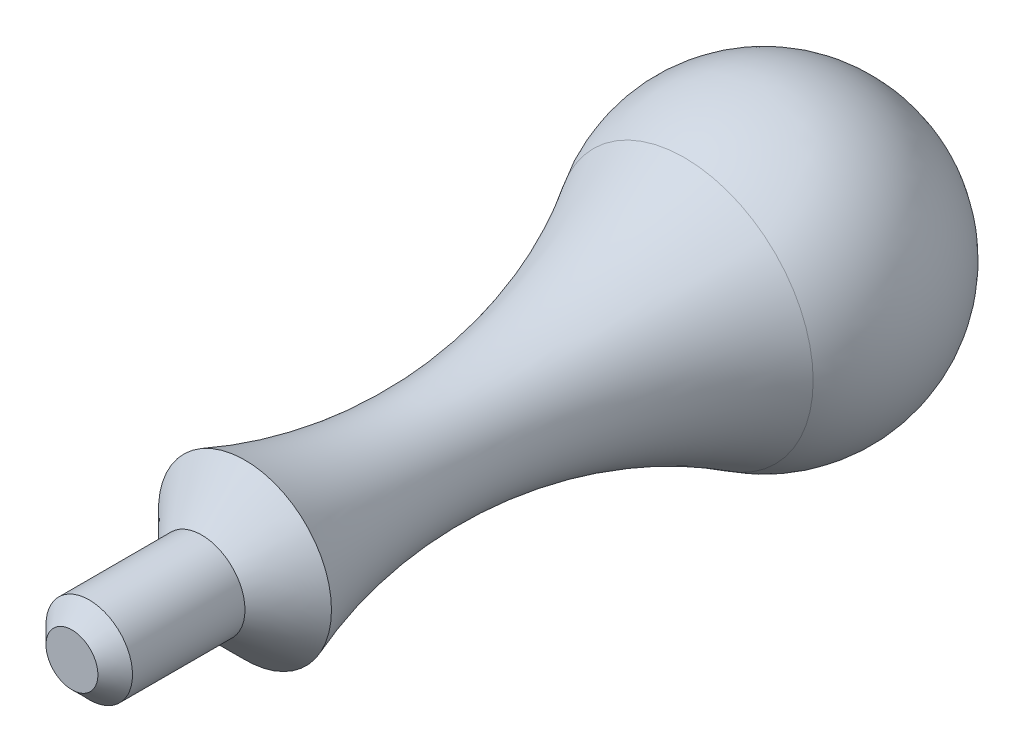
ISO-10303-21;
HEADER;
FILE_DESCRIPTION(('STEP AP214'),'2;1');
FILE_NAME('part.step','',(''),(''),'','','');
FILE_SCHEMA(('AUTOMOTIVE_DESIGN { 1 0 10303 214 1 1 1 1 }'));
ENDSEC;
DATA;
#1=APPLICATION_CONTEXT('core data for automotive mechanical design processes');
#2=APPLICATION_PROTOCOL_DEFINITION('international standard','automotive_design',2000,#1);
#3=PRODUCT_CONTEXT('',#1,'mechanical');
#4=PRODUCT('Part','Part','',(#3));
#5=PRODUCT_RELATED_PRODUCT_CATEGORY('part','',(#4));
#6=PRODUCT_DEFINITION_FORMATION('','',#4);
#7=PRODUCT_DEFINITION_CONTEXT('part definition',#1,'design');
#8=PRODUCT_DEFINITION('design','',#6,#7);
#9=PRODUCT_DEFINITION_SHAPE('','',#8);
#10=(LENGTH_UNIT() NAMED_UNIT(*) SI_UNIT(.MILLI.,.METRE.));
#11=(NAMED_UNIT(*) PLANE_ANGLE_UNIT() SI_UNIT($,.RADIAN.));
#12=(NAMED_UNIT(*) SI_UNIT($,.STERADIAN.) SOLID_ANGLE_UNIT());
#13=UNCERTAINTY_MEASURE_WITH_UNIT(LENGTH_MEASURE(1.E-05),#10,'distance_accuracy_value','');
#14=(GEOMETRIC_REPRESENTATION_CONTEXT(3) GLOBAL_UNCERTAINTY_ASSIGNED_CONTEXT((#13)) GLOBAL_UNIT_ASSIGNED_CONTEXT((#10,
#11,#12)) REPRESENTATION_CONTEXT('',''));
#15=CARTESIAN_POINT('',(0.,0.,0.));
#16=DIRECTION('',(0.,0.,1.));
#17=DIRECTION('',(1.,0.,0.));
#18=AXIS2_PLACEMENT_3D('',#15,#16,#17);
#19=CARTESIAN_POINT('',(0.,3.17500000000001,50.8));
#20=DIRECTION('',(0.,0.,-0.999999999999999));
#21=DIRECTION('',(-1.,0.,0.));
#22=AXIS2_PLACEMENT_3D('',#19,#20,#21);
#23=PLANE('',#22);
#24=CARTESIAN_POINT('',(0.,0.,50.8));
#25=DIRECTION('',(0.,0.,-0.999999999999999));
#26=DIRECTION('',(-1.,0.,0.));
#27=AXIS2_PLACEMENT_3D('',#24,#25,#26);
#28=CIRCLE('',#27,1.90499999999999);
#29=CARTESIAN_POINT('',(-1.90499999999999,0.,50.8));
#30=VERTEX_POINT('',#29);
#31=EDGE_CURVE('E62',#30,#30,#28,.F.);
#32=ORIENTED_EDGE('',*,*,#31,.T.);
#33=EDGE_LOOP('',(#32));
#34=FACE_BOUND('',#33,.T.);
#35=ADVANCED_FACE('F53',(#34),#23,.F.);
#36=CARTESIAN_POINT('',(0.,0.,0.));
#37=DIRECTION('',(0.,0.,0.999999999999999));
#38=DIRECTION('',(0.,1.,0.));
#39=AXIS2_PLACEMENT_3D('',#36,#37,#38);
#40=SPHERICAL_SURFACE('',#39,11.1125);
#41=CARTESIAN_POINT('',(0.,0.,5.84317084164787));
#42=DIRECTION('',(0.,0.,0.999999999999999));
#43=DIRECTION('',(1.,0.,0.));
#44=AXIS2_PLACEMENT_3D('',#41,#42,#43);
#45=CIRCLE('',#44,9.45224897922796);
#46=CARTESIAN_POINT('',(9.45224897922796,0.,5.84317084164787));
#47=VERTEX_POINT('',#46);
#48=EDGE_CURVE('E69',#47,#47,#45,.T.);
#49=ORIENTED_EDGE('',*,*,#48,.F.);
#50=EDGE_LOOP('',(#49));
#51=FACE_BOUND('',#50,.T.);
#52=ADVANCED_FACE('F100',(#51),#40,.T.);
#53=CARTESIAN_POINT('',(0.,0.,25.1197240919534));
#54=DIRECTION('',(0.,0.,0.999999999999999));
#55=DIRECTION('',(1.,0.,0.));
#56=AXIS2_PLACEMENT_3D('',#53,#54,#55);
#57=TOROIDAL_SURFACE('',#56,40.6351094022938,36.6600094022938);
#58=CARTESIAN_POINT('',(0.,0.,38.1));
#59=DIRECTION('',(0.,0.,0.999999999999999));
#60=DIRECTION('',(1.,0.,0.));
#61=AXIS2_PLACEMENT_3D('',#58,#59,#60);
#62=CIRCLE('',#61,6.34999999999999);
#63=CARTESIAN_POINT('',(6.34999999999999,0.,38.1));
#64=VERTEX_POINT('',#63);
#65=EDGE_CURVE('E76',#64,#64,#62,.T.);
#66=ORIENTED_EDGE('',*,*,#65,.F.);
#67=EDGE_LOOP('',(#66));
#68=FACE_BOUND('',#67,.T.);
#69=ORIENTED_EDGE('',*,*,#48,.T.);
#70=EDGE_LOOP('',(#69));
#71=FACE_BOUND('',#70,.T.);
#72=ADVANCED_FACE('F94',(#68,#71),#57,.F.);
#73=CARTESIAN_POINT('',(0.,0.,38.1));
#74=DIRECTION('',(0.,0.,-0.999999999999999));
#75=DIRECTION('',(-1.,0.,0.));
#76=AXIS2_PLACEMENT_3D('',#73,#74,#75);
#77=CONICAL_SURFACE('',#76,6.34999999999999,0.785398163397443);
#78=CARTESIAN_POINT('',(0.,0.,41.2749999999999));
#79=DIRECTION('',(0.,0.,0.999999999999999));
#80=DIRECTION('',(1.,0.,0.));
#81=AXIS2_PLACEMENT_3D('',#78,#79,#80);
#82=CIRCLE('',#81,3.175);
#83=CARTESIAN_POINT('',(3.175,0.,41.2749999999999));
#84=VERTEX_POINT('',#83);
#85=EDGE_CURVE('E82',#84,#84,#82,.T.);
#86=ORIENTED_EDGE('',*,*,#85,.F.);
#87=EDGE_LOOP('',(#86));
#88=FACE_BOUND('',#87,.T.);
#89=ORIENTED_EDGE('',*,*,#65,.T.);
#90=EDGE_LOOP('',(#89));
#91=FACE_BOUND('',#90,.T.);
#92=ADVANCED_FACE('F91',(#88,#91),#77,.T.);
#93=CARTESIAN_POINT('',(0.,0.,56.752837160245));
#94=DIRECTION('',(0.,0.,0.999999999999999));
#95=DIRECTION('',(1.,0.,0.));
#96=AXIS2_PLACEMENT_3D('',#93,#94,#95);
#97=CYLINDRICAL_SURFACE('',#96,3.175);
#98=CARTESIAN_POINT('',(0.,0.,49.53));
#99=DIRECTION('',(0.,0.,-0.999999999999999));
#100=DIRECTION('',(-1.,0.,0.));
#101=AXIS2_PLACEMENT_3D('',#98,#99,#100);
#102=CIRCLE('',#101,3.175);
#103=CARTESIAN_POINT('',(-3.175,0.,49.53));
#104=VERTEX_POINT('',#103);
#105=EDGE_CURVE('E10',#104,#104,#102,.T.);
#106=ORIENTED_EDGE('',*,*,#105,.T.);
#107=EDGE_LOOP('',(#106));
#108=FACE_BOUND('',#107,.T.);
#109=ORIENTED_EDGE('',*,*,#85,.T.);
#110=EDGE_LOOP('',(#109));
#111=FACE_BOUND('',#110,.T.);
#112=ADVANCED_FACE('F89',(#108,#111),#97,.T.);
#113=CARTESIAN_POINT('',(0.,0.,50.8));
#114=DIRECTION('',(0.,0.,-0.999999999999999));
#115=DIRECTION('',(-1.,0.,0.));
#116=AXIS2_PLACEMENT_3D('',#113,#114,#115);
#117=CONICAL_SURFACE('',#116,1.90499999999999,0.785398163397449);
#118=ORIENTED_EDGE('',*,*,#105,.F.);
#119=EDGE_LOOP('',(#118));
#120=FACE_BOUND('',#119,.T.);
#121=ORIENTED_EDGE('',*,*,#31,.F.);
#122=EDGE_LOOP('',(#121));
#123=FACE_BOUND('',#122,.T.);
#124=ADVANCED_FACE('F56',(#120,#123),#117,.T.);
#125=CLOSED_SHELL('',(#35,#52,#72,#92,#112,#124));
#126=MANIFOLD_SOLID_BREP('B2',#125);
#127=ADVANCED_BREP_SHAPE_REPRESENTATION('',(#18,#126),#14);
#128=SHAPE_DEFINITION_REPRESENTATION(#9,#127);
ENDSEC;
END-ISO-10303-21;
